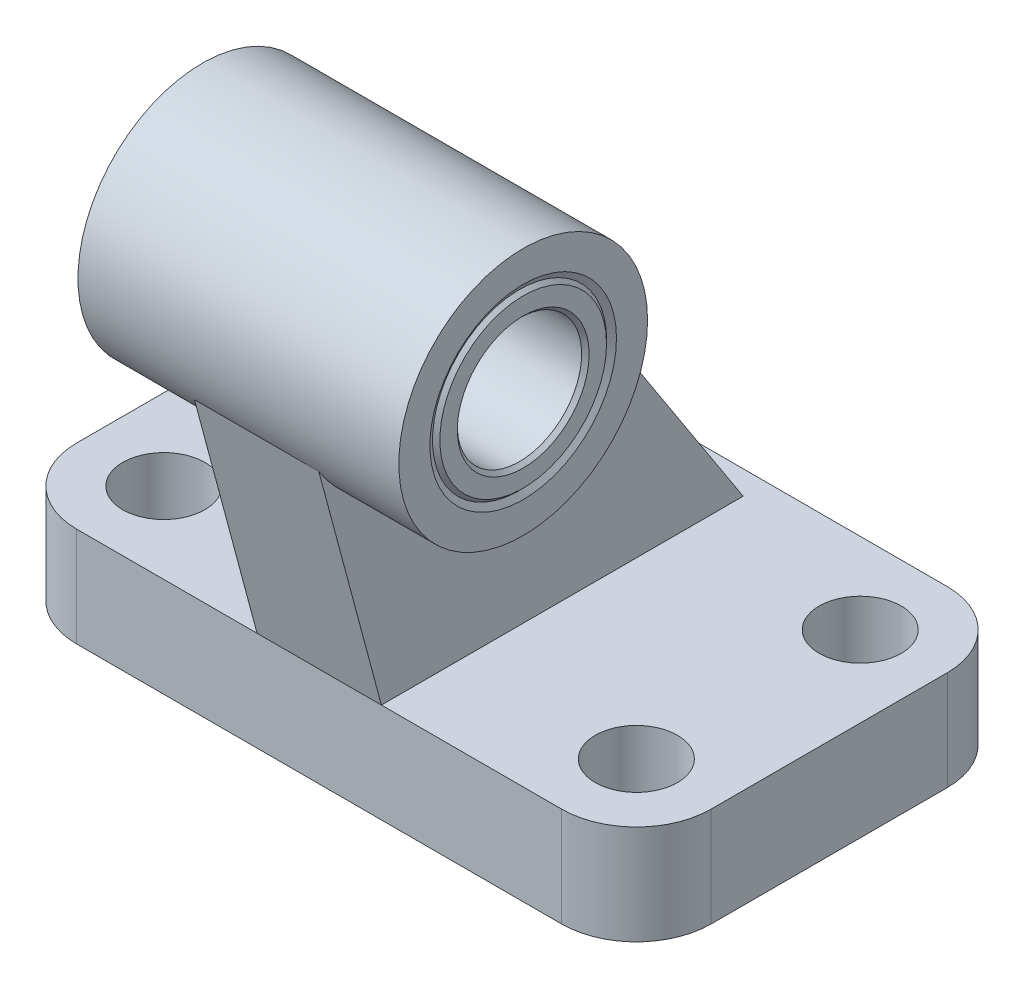
ISO-10303-21;
HEADER;
FILE_DESCRIPTION(('STEP AP214'),'2;1');
FILE_NAME('part.step','',(''),(''),'','','');
FILE_SCHEMA(('AUTOMOTIVE_DESIGN { 1 0 10303 214 1 1 1 1 }'));
ENDSEC;
DATA;
#1=APPLICATION_CONTEXT('core data for automotive mechanical design processes');
#2=APPLICATION_PROTOCOL_DEFINITION('international standard','automotive_design',2000,#1);
#3=PRODUCT_CONTEXT('',#1,'mechanical');
#4=PRODUCT('Part','Part','',(#3));
#5=PRODUCT_RELATED_PRODUCT_CATEGORY('part','',(#4));
#6=PRODUCT_DEFINITION_FORMATION('','',#4);
#7=PRODUCT_DEFINITION_CONTEXT('part definition',#1,'design');
#8=PRODUCT_DEFINITION('design','',#6,#7);
#9=PRODUCT_DEFINITION_SHAPE('','',#8);
#10=(LENGTH_UNIT() NAMED_UNIT(*) SI_UNIT(.MILLI.,.METRE.));
#11=(NAMED_UNIT(*) PLANE_ANGLE_UNIT() SI_UNIT($,.RADIAN.));
#12=(NAMED_UNIT(*) SI_UNIT($,.STERADIAN.) SOLID_ANGLE_UNIT());
#13=UNCERTAINTY_MEASURE_WITH_UNIT(LENGTH_MEASURE(1.E-05),#10,'distance_accuracy_value','');
#14=(GEOMETRIC_REPRESENTATION_CONTEXT(3) GLOBAL_UNCERTAINTY_ASSIGNED_CONTEXT((#13)) GLOBAL_UNIT_ASSIGNED_CONTEXT((#10,
#11,#12)) REPRESENTATION_CONTEXT('',''));
#15=CARTESIAN_POINT('',(0.,0.,0.));
#16=DIRECTION('',(0.,0.,1.));
#17=DIRECTION('',(1.,0.,0.));
#18=AXIS2_PLACEMENT_3D('',#15,#16,#17);
#19=CARTESIAN_POINT('',(12.9,32.,12.));
#20=DIRECTION('',(1.,0.,0.));
#21=DIRECTION('',(0.,0.,-1.));
#22=AXIS2_PLACEMENT_3D('',#19,#20,#21);
#23=CYLINDRICAL_SURFACE('',#22,7.);
#24=CARTESIAN_POINT('',(12.6,32.,12.));
#25=DIRECTION('',(1.,0.,0.));
#26=DIRECTION('',(0.,0.,-1.));
#27=AXIS2_PLACEMENT_3D('',#24,#25,#26);
#28=CIRCLE('',#27,7.);
#29=CARTESIAN_POINT('',(12.6,32.,5.));
#30=VERTEX_POINT('',#29);
#31=EDGE_CURVE('E512',#30,#30,#28,.T.);
#32=ORIENTED_EDGE('',*,*,#31,.F.);
#33=EDGE_LOOP('',(#32));
#34=FACE_BOUND('',#33,.T.);
#35=CARTESIAN_POINT('',(12.6113248654052,32.,12.));
#36=DIRECTION('',(1.,0.,0.));
#37=DIRECTION('',(0.,0.,-1.));
#38=AXIS2_PLACEMENT_3D('',#35,#36,#37);
#39=CIRCLE('',#38,7.);
#40=CARTESIAN_POINT('',(12.6113248654052,32.,5.));
#41=VERTEX_POINT('',#40);
#42=EDGE_CURVE('E303',#41,#41,#39,.T.);
#43=ORIENTED_EDGE('',*,*,#42,.T.);
#44=EDGE_LOOP('',(#43));
#45=FACE_BOUND('',#44,.T.);
#46=ADVANCED_FACE('F32',(#34,#45),#23,.F.);
#47=CARTESIAN_POINT('',(5.,29.5173048454133,21.2655444566228));
#48=DIRECTION('',(0.,0.258819045102522,-0.965925826289068));
#49=DIRECTION('',(0.,0.965925826289068,0.258819045102522));
#50=AXIS2_PLACEMENT_3D('',#47,#48,#49);
#51=PLANE('',#50);
#52=DIRECTION('',(-1.,0.,0.));
#53=VECTOR('',#52,1.);
#54=CARTESIAN_POINT('',(12.9,26.7876608921533,20.5341385637223));
#55=LINE('',#54,#53);
#56=CARTESIAN_POINT('',(-5.,26.7876608921533,20.5341385637223));
#57=VERTEX_POINT('',#56);
#58=CARTESIAN_POINT('',(5.,26.7876608921533,20.5341385637223));
#59=VERTEX_POINT('',#58);
#60=EDGE_CURVE('E132',#57,#59,#55,.F.);
#61=ORIENTED_EDGE('',*,*,#60,.F.);
#62=DIRECTION('',(0.,-0.965925826289068,-0.258819045102522));
#63=VECTOR('',#62,1.);
#64=CARTESIAN_POINT('',(-5.,29.5173048454133,21.2655444566228));
#65=LINE('',#64,#63);
#66=CARTESIAN_POINT('',(-5.,8.,15.5));
#67=VERTEX_POINT('',#66);
#68=EDGE_CURVE('E122',#57,#67,#65,.T.);
#69=ORIENTED_EDGE('',*,*,#68,.T.);
#70=DIRECTION('',(-1.,0.,0.));
#71=VECTOR('',#70,1.);
#72=CARTESIAN_POINT('',(5.,8.,15.5));
#73=LINE('',#72,#71);
#74=CARTESIAN_POINT('',(5.,8.,15.5));
#75=VERTEX_POINT('',#74);
#76=EDGE_CURVE('E159',#75,#67,#73,.T.);
#77=ORIENTED_EDGE('',*,*,#76,.F.);
#78=DIRECTION('',(0.,-0.965925826289068,-0.258819045102522));
#79=VECTOR('',#78,1.);
#80=CARTESIAN_POINT('',(5.,29.5173048454133,21.2655444566228));
#81=LINE('',#80,#79);
#82=EDGE_CURVE('E134',#59,#75,#81,.T.);
#83=ORIENTED_EDGE('',*,*,#82,.F.);
#84=EDGE_LOOP('',(#61,#69,#77,#83));
#85=FACE_BOUND('',#84,.T.);
#86=ADVANCED_FACE('F133',(#85),#51,.F.);
#87=CARTESIAN_POINT('',(5.,8.,-13.5857822367403));
#88=DIRECTION('',(0.,-0.544639035015027,0.838670567945424));
#89=DIRECTION('',(0.,-0.838670567945424,-0.544639035015027));
#90=AXIS2_PLACEMENT_3D('',#87,#88,#89);
#91=PLANE('',#90);
#92=DIRECTION('',(-1.,0.,0.));
#93=VECTOR('',#92,1.);
#94=CARTESIAN_POINT('',(12.9,32.0000000000001,2.));
#95=LINE('',#94,#93);
#96=CARTESIAN_POINT('',(5.,32.0000000000001,2.));
#97=VERTEX_POINT('',#96);
#98=CARTESIAN_POINT('',(-5.,32.0000000000001,2.));
#99=VERTEX_POINT('',#98);
#100=EDGE_CURVE('E47',#97,#99,#95,.T.);
#101=ORIENTED_EDGE('',*,*,#100,.F.);
#102=DIRECTION('',(0.,0.838670567945424,0.544639035015027));
#103=VECTOR('',#102,1.);
#104=CARTESIAN_POINT('',(5.,8.,-13.5857822367403));
#105=LINE('',#104,#103);
#106=CARTESIAN_POINT('',(5.,8.,-13.5857822367403));
#107=VERTEX_POINT('',#106);
#108=EDGE_CURVE('E154',#107,#97,#105,.T.);
#109=ORIENTED_EDGE('',*,*,#108,.F.);
#110=DIRECTION('',(-1.,0.,0.));
#111=VECTOR('',#110,1.);
#112=CARTESIAN_POINT('',(5.,8.,-13.5857822367403));
#113=LINE('',#112,#111);
#114=CARTESIAN_POINT('',(-5.,8.,-13.5857822367403));
#115=VERTEX_POINT('',#114);
#116=EDGE_CURVE('E156',#107,#115,#113,.T.);
#117=ORIENTED_EDGE('',*,*,#116,.T.);
#118=DIRECTION('',(0.,0.838670567945424,0.544639035015027));
#119=VECTOR('',#118,1.);
#120=CARTESIAN_POINT('',(-5.,8.,-13.5857822367403));
#121=LINE('',#120,#119);
#122=EDGE_CURVE('E148',#115,#99,#121,.T.);
#123=ORIENTED_EDGE('',*,*,#122,.T.);
#124=EDGE_LOOP('',(#101,#109,#117,#123));
#125=FACE_BOUND('',#124,.T.);
#126=ADVANCED_FACE('F276',(#125),#91,.F.);
#127=CARTESIAN_POINT('',(-19.5000000000001,8.,9.50000000000006));
#128=DIRECTION('',(0.,1.,0.));
#129=DIRECTION('',(0.,0.,1.));
#130=AXIS2_PLACEMENT_3D('',#127,#128,#129);
#131=PLANE('',#130);
#132=CARTESIAN_POINT('',(19.,8.,-9.));
#133=DIRECTION('',(0.,1.,0.));
#134=DIRECTION('',(0.,0.,1.));
#135=AXIS2_PLACEMENT_3D('',#132,#133,#134);
#136=CIRCLE('',#135,3.3);
#137=CARTESIAN_POINT('',(19.,8.,-5.7));
#138=VERTEX_POINT('',#137);
#139=EDGE_CURVE('E306',#138,#138,#136,.T.);
#140=ORIENTED_EDGE('',*,*,#139,.F.);
#141=EDGE_LOOP('',(#140));
#142=FACE_BOUND('',#141,.T.);
#143=CARTESIAN_POINT('',(-19.,8.,-9.));
#144=DIRECTION('',(0.,1.,0.));
#145=DIRECTION('',(0.,0.,1.));
#146=AXIS2_PLACEMENT_3D('',#143,#144,#145);
#147=CIRCLE('',#146,3.3);
#148=CARTESIAN_POINT('',(-19.,8.,-5.7));
#149=VERTEX_POINT('',#148);
#150=EDGE_CURVE('E318',#149,#149,#147,.T.);
#151=ORIENTED_EDGE('',*,*,#150,.F.);
#152=EDGE_LOOP('',(#151));
#153=FACE_BOUND('',#152,.T.);
#154=CARTESIAN_POINT('',(19.,8.,9.));
#155=DIRECTION('',(0.,1.,0.));
#156=DIRECTION('',(0.,0.,1.));
#157=AXIS2_PLACEMENT_3D('',#154,#155,#156);
#158=CIRCLE('',#157,3.3);
#159=CARTESIAN_POINT('',(19.,8.,12.3));
#160=VERTEX_POINT('',#159);
#161=EDGE_CURVE('E324',#160,#160,#158,.T.);
#162=ORIENTED_EDGE('',*,*,#161,.F.);
#163=EDGE_LOOP('',(#162));
#164=FACE_BOUND('',#163,.T.);
#165=CARTESIAN_POINT('',(-19.,8.,9.));
#166=DIRECTION('',(0.,1.,0.));
#167=DIRECTION('',(0.,0.,1.));
#168=AXIS2_PLACEMENT_3D('',#165,#166,#167);
#169=CIRCLE('',#168,3.3);
#170=CARTESIAN_POINT('',(-19.,8.,12.3));
#171=VERTEX_POINT('',#170);
#172=EDGE_CURVE('E330',#171,#171,#169,.T.);
#173=ORIENTED_EDGE('',*,*,#172,.F.);
#174=EDGE_LOOP('',(#173));
#175=FACE_BOUND('',#174,.T.);
#176=DIRECTION('',(1.,0.,0.));
#177=VECTOR('',#176,1.);
#178=CARTESIAN_POINT('',(-19.5,8.,15.5));
#179=LINE('',#178,#177);
#180=CARTESIAN_POINT('',(-19.5,8.,15.5));
#181=VERTEX_POINT('',#180);
#182=EDGE_CURVE('E167',#181,#67,#179,.T.);
#183=ORIENTED_EDGE('',*,*,#182,.T.);
#184=DIRECTION('',(0.,0.,-1.));
#185=VECTOR('',#184,1.);
#186=CARTESIAN_POINT('',(-5.,8.,15.5));
#187=LINE('',#186,#185);
#188=EDGE_CURVE('E126',#67,#115,#187,.T.);
#189=ORIENTED_EDGE('',*,*,#188,.T.);
#190=ORIENTED_EDGE('',*,*,#116,.F.);
#191=DIRECTION('',(0.,0.,-1.));
#192=VECTOR('',#191,1.);
#193=CARTESIAN_POINT('',(5.,8.,15.5));
#194=LINE('',#193,#192);
#195=EDGE_CURVE('E151',#75,#107,#194,.T.);
#196=ORIENTED_EDGE('',*,*,#195,.F.);
#197=CARTESIAN_POINT('',(19.5,8.,15.5));
#198=VERTEX_POINT('',#197);
#199=EDGE_CURVE('E165',#75,#198,#179,.T.);
#200=ORIENTED_EDGE('',*,*,#199,.T.);
#201=CARTESIAN_POINT('',(19.5000000000001,8.,9.50000000000005));
#202=DIRECTION('',(0.,1.,0.));
#203=DIRECTION('',(0.,0.,1.));
#204=AXIS2_PLACEMENT_3D('',#201,#202,#203);
#205=CIRCLE('',#204,5.99999999999994);
#206=CARTESIAN_POINT('',(25.5,8.,9.5));
#207=VERTEX_POINT('',#206);
#208=EDGE_CURVE('E170',#198,#207,#205,.T.);
#209=ORIENTED_EDGE('',*,*,#208,.T.);
#210=DIRECTION('',(0.,0.,-1.));
#211=VECTOR('',#210,1.);
#212=CARTESIAN_POINT('',(25.5,8.,9.5));
#213=LINE('',#212,#211);
#214=CARTESIAN_POINT('',(25.5,8.,-9.5));
#215=VERTEX_POINT('',#214);
#216=EDGE_CURVE('E172',#207,#215,#213,.T.);
#217=ORIENTED_EDGE('',*,*,#216,.T.);
#218=CARTESIAN_POINT('',(19.5000000000001,8.,-9.50000000000006));
#219=DIRECTION('',(0.,1.,0.));
#220=DIRECTION('',(0.,0.,1.));
#221=AXIS2_PLACEMENT_3D('',#218,#219,#220);
#222=CIRCLE('',#221,5.99999999999995);
#223=CARTESIAN_POINT('',(19.5,8.,-15.5));
#224=VERTEX_POINT('',#223);
#225=EDGE_CURVE('E174',#215,#224,#222,.T.);
#226=ORIENTED_EDGE('',*,*,#225,.T.);
#227=DIRECTION('',(-1.,0.,0.));
#228=VECTOR('',#227,1.);
#229=CARTESIAN_POINT('',(19.5,8.,-15.5));
#230=LINE('',#229,#228);
#231=CARTESIAN_POINT('',(-19.5,8.,-15.5));
#232=VERTEX_POINT('',#231);
#233=EDGE_CURVE('E176',#224,#232,#230,.T.);
#234=ORIENTED_EDGE('',*,*,#233,.T.);
#235=CARTESIAN_POINT('',(-19.5000000000001,8.,-9.50000000000005));
#236=DIRECTION('',(0.,1.,0.));
#237=DIRECTION('',(0.,0.,1.));
#238=AXIS2_PLACEMENT_3D('',#235,#236,#237);
#239=CIRCLE('',#238,5.99999999999994);
#240=CARTESIAN_POINT('',(-25.5,8.,-9.5));
#241=VERTEX_POINT('',#240);
#242=EDGE_CURVE('E178',#232,#241,#239,.T.);
#243=ORIENTED_EDGE('',*,*,#242,.T.);
#244=DIRECTION('',(0.,0.,1.));
#245=VECTOR('',#244,1.);
#246=CARTESIAN_POINT('',(-25.5,8.,-9.5));
#247=LINE('',#246,#245);
#248=CARTESIAN_POINT('',(-25.5,8.,9.5));
#249=VERTEX_POINT('',#248);
#250=EDGE_CURVE('E180',#241,#249,#247,.T.);
#251=ORIENTED_EDGE('',*,*,#250,.T.);
#252=CARTESIAN_POINT('',(-19.5000000000001,8.,9.50000000000006));
#253=DIRECTION('',(0.,1.,0.));
#254=DIRECTION('',(0.,0.,1.));
#255=AXIS2_PLACEMENT_3D('',#252,#253,#254);
#256=CIRCLE('',#255,5.99999999999995);
#257=EDGE_CURVE('E162',#249,#181,#256,.T.);
#258=ORIENTED_EDGE('',*,*,#257,.T.);
#259=EDGE_LOOP('',(#183,#189,#190,#196,#200,#209,#217,#226,#234,#243,#251,#258));
#260=FACE_BOUND('',#259,.T.);
#261=ADVANCED_FACE('F243',(#142,#153,#164,#175,#260),#131,.T.);
#262=CARTESIAN_POINT('',(-19.5000000000001,8.,9.50000000000006));
#263=DIRECTION('',(0.,-1.,0.));
#264=DIRECTION('',(0.,0.,-1.));
#265=AXIS2_PLACEMENT_3D('',#262,#263,#264);
#266=CYLINDRICAL_SURFACE('',#265,5.99999999999995);
#267=CARTESIAN_POINT('',(-19.5000000000001,0.,9.50000000000006));
#268=DIRECTION('',(0.,1.,0.));
#269=DIRECTION('',(0.,0.,1.));
#270=AXIS2_PLACEMENT_3D('',#267,#268,#269);
#271=CIRCLE('',#270,5.99999999999995);
#272=CARTESIAN_POINT('',(-25.5,0.,9.5));
#273=VERTEX_POINT('',#272);
#274=CARTESIAN_POINT('',(-19.5,0.,15.5));
#275=VERTEX_POINT('',#274);
#276=EDGE_CURVE('E161',#273,#275,#271,.T.);
#277=ORIENTED_EDGE('',*,*,#276,.T.);
#278=DIRECTION('',(0.,-1.,0.));
#279=VECTOR('',#278,1.);
#280=CARTESIAN_POINT('',(-19.5,8.,15.5));
#281=LINE('',#280,#279);
#282=EDGE_CURVE('E40',#181,#275,#281,.T.);
#283=ORIENTED_EDGE('',*,*,#282,.F.);
#284=ORIENTED_EDGE('',*,*,#257,.F.);
#285=DIRECTION('',(0.,-1.,0.));
#286=VECTOR('',#285,1.);
#287=CARTESIAN_POINT('',(-25.5,8.,9.5));
#288=LINE('',#287,#286);
#289=EDGE_CURVE('E182',#249,#273,#288,.T.);
#290=ORIENTED_EDGE('',*,*,#289,.T.);
#291=EDGE_LOOP('',(#277,#283,#284,#290));
#292=FACE_BOUND('',#291,.T.);
#293=ADVANCED_FACE('F34',(#292),#266,.T.);
#294=CARTESIAN_POINT('',(-19.5,8.,15.5));
#295=DIRECTION('',(0.,0.,-1.));
#296=DIRECTION('',(-1.,0.,0.));
#297=AXIS2_PLACEMENT_3D('',#294,#295,#296);
#298=PLANE('',#297);
#299=DIRECTION('',(1.,0.,0.));
#300=VECTOR('',#299,1.);
#301=CARTESIAN_POINT('',(-19.5,0.,15.5));
#302=LINE('',#301,#300);
#303=CARTESIAN_POINT('',(19.5,0.,15.5));
#304=VERTEX_POINT('',#303);
#305=EDGE_CURVE('E185',#275,#304,#302,.T.);
#306=ORIENTED_EDGE('',*,*,#305,.T.);
#307=DIRECTION('',(0.,-1.,0.));
#308=VECTOR('',#307,1.);
#309=CARTESIAN_POINT('',(19.5,8.,15.5));
#310=LINE('',#309,#308);
#311=EDGE_CURVE('E215',#198,#304,#310,.T.);
#312=ORIENTED_EDGE('',*,*,#311,.F.);
#313=ORIENTED_EDGE('',*,*,#199,.F.);
#314=ORIENTED_EDGE('',*,*,#76,.T.);
#315=ORIENTED_EDGE('',*,*,#182,.F.);
#316=ORIENTED_EDGE('',*,*,#282,.T.);
#317=EDGE_LOOP('',(#306,#312,#313,#314,#315,#316));
#318=FACE_BOUND('',#317,.T.);
#319=ADVANCED_FACE('F220',(#318),#298,.F.);
#320=CARTESIAN_POINT('',(19.5000000000001,8.,9.50000000000005));
#321=DIRECTION('',(0.,-1.,0.));
#322=DIRECTION('',(0.,0.,-1.));
#323=AXIS2_PLACEMENT_3D('',#320,#321,#322);
#324=CYLINDRICAL_SURFACE('',#323,5.99999999999994);
#325=CARTESIAN_POINT('',(19.5000000000001,0.,9.50000000000005));
#326=DIRECTION('',(0.,1.,0.));
#327=DIRECTION('',(0.,0.,1.));
#328=AXIS2_PLACEMENT_3D('',#325,#326,#327);
#329=CIRCLE('',#328,5.99999999999994);
#330=CARTESIAN_POINT('',(25.5,0.,9.5));
#331=VERTEX_POINT('',#330);
#332=EDGE_CURVE('E187',#304,#331,#329,.T.);
#333=ORIENTED_EDGE('',*,*,#332,.T.);
#334=DIRECTION('',(0.,-1.,0.));
#335=VECTOR('',#334,1.);
#336=CARTESIAN_POINT('',(25.5,8.,9.5));
#337=LINE('',#336,#335);
#338=EDGE_CURVE('E212',#207,#331,#337,.T.);
#339=ORIENTED_EDGE('',*,*,#338,.F.);
#340=ORIENTED_EDGE('',*,*,#208,.F.);
#341=ORIENTED_EDGE('',*,*,#311,.T.);
#342=EDGE_LOOP('',(#333,#339,#340,#341));
#343=FACE_BOUND('',#342,.T.);
#344=ADVANCED_FACE('F235',(#343),#324,.T.);
#345=CARTESIAN_POINT('',(25.5,8.,9.5));
#346=DIRECTION('',(-1.,0.,0.));
#347=DIRECTION('',(0.,0.,1.));
#348=AXIS2_PLACEMENT_3D('',#345,#346,#347);
#349=PLANE('',#348);
#350=DIRECTION('',(0.,0.,-1.));
#351=VECTOR('',#350,1.);
#352=CARTESIAN_POINT('',(25.5,0.,9.5));
#353=LINE('',#352,#351);
#354=CARTESIAN_POINT('',(25.5,0.,-9.5));
#355=VERTEX_POINT('',#354);
#356=EDGE_CURVE('E189',#331,#355,#353,.T.);
#357=ORIENTED_EDGE('',*,*,#356,.T.);
#358=DIRECTION('',(0.,-1.,0.));
#359=VECTOR('',#358,1.);
#360=CARTESIAN_POINT('',(25.5,8.,-9.5));
#361=LINE('',#360,#359);
#362=EDGE_CURVE('E209',#215,#355,#361,.T.);
#363=ORIENTED_EDGE('',*,*,#362,.F.);
#364=ORIENTED_EDGE('',*,*,#216,.F.);
#365=ORIENTED_EDGE('',*,*,#338,.T.);
#366=EDGE_LOOP('',(#357,#363,#364,#365));
#367=FACE_BOUND('',#366,.T.);
#368=ADVANCED_FACE('F239',(#367),#349,.F.);
#369=CARTESIAN_POINT('',(19.5000000000001,8.,-9.50000000000006));
#370=DIRECTION('',(0.,-1.,0.));
#371=DIRECTION('',(0.,0.,-1.));
#372=AXIS2_PLACEMENT_3D('',#369,#370,#371);
#373=CYLINDRICAL_SURFACE('',#372,5.99999999999995);
#374=CARTESIAN_POINT('',(19.5000000000001,0.,-9.50000000000006));
#375=DIRECTION('',(0.,1.,0.));
#376=DIRECTION('',(0.,0.,1.));
#377=AXIS2_PLACEMENT_3D('',#374,#375,#376);
#378=CIRCLE('',#377,5.99999999999995);
#379=CARTESIAN_POINT('',(19.5,0.,-15.5));
#380=VERTEX_POINT('',#379);
#381=EDGE_CURVE('E191',#355,#380,#378,.T.);
#382=ORIENTED_EDGE('',*,*,#381,.T.);
#383=DIRECTION('',(0.,-1.,0.));
#384=VECTOR('',#383,1.);
#385=CARTESIAN_POINT('',(19.5,8.,-15.5));
#386=LINE('',#385,#384);
#387=EDGE_CURVE('E206',#224,#380,#386,.T.);
#388=ORIENTED_EDGE('',*,*,#387,.F.);
#389=ORIENTED_EDGE('',*,*,#225,.F.);
#390=ORIENTED_EDGE('',*,*,#362,.T.);
#391=EDGE_LOOP('',(#382,#388,#389,#390));
#392=FACE_BOUND('',#391,.T.);
#393=ADVANCED_FACE('F260',(#392),#373,.T.);
#394=CARTESIAN_POINT('',(19.5,8.,-15.5));
#395=DIRECTION('',(0.,0.,1.));
#396=DIRECTION('',(1.,0.,0.));
#397=AXIS2_PLACEMENT_3D('',#394,#395,#396);
#398=PLANE('',#397);
#399=DIRECTION('',(-1.,0.,0.));
#400=VECTOR('',#399,1.);
#401=CARTESIAN_POINT('',(19.5,0.,-15.5));
#402=LINE('',#401,#400);
#403=CARTESIAN_POINT('',(-19.5,0.,-15.5));
#404=VERTEX_POINT('',#403);
#405=EDGE_CURVE('E193',#380,#404,#402,.T.);
#406=ORIENTED_EDGE('',*,*,#405,.T.);
#407=DIRECTION('',(0.,-1.,0.));
#408=VECTOR('',#407,1.);
#409=CARTESIAN_POINT('',(-19.5,8.,-15.5));
#410=LINE('',#409,#408);
#411=EDGE_CURVE('E203',#232,#404,#410,.T.);
#412=ORIENTED_EDGE('',*,*,#411,.F.);
#413=ORIENTED_EDGE('',*,*,#233,.F.);
#414=ORIENTED_EDGE('',*,*,#387,.T.);
#415=EDGE_LOOP('',(#406,#412,#413,#414));
#416=FACE_BOUND('',#415,.T.);
#417=ADVANCED_FACE('F257',(#416),#398,.F.);
#418=CARTESIAN_POINT('',(-19.5000000000001,8.,-9.50000000000005));
#419=DIRECTION('',(0.,-1.,0.));
#420=DIRECTION('',(0.,0.,-1.));
#421=AXIS2_PLACEMENT_3D('',#418,#419,#420);
#422=CYLINDRICAL_SURFACE('',#421,5.99999999999994);
#423=CARTESIAN_POINT('',(-19.5000000000001,0.,-9.50000000000005));
#424=DIRECTION('',(0.,1.,0.));
#425=DIRECTION('',(0.,0.,1.));
#426=AXIS2_PLACEMENT_3D('',#423,#424,#425);
#427=CIRCLE('',#426,5.99999999999994);
#428=CARTESIAN_POINT('',(-25.5,0.,-9.5));
#429=VERTEX_POINT('',#428);
#430=EDGE_CURVE('E195',#404,#429,#427,.T.);
#431=ORIENTED_EDGE('',*,*,#430,.T.);
#432=DIRECTION('',(0.,-1.,0.));
#433=VECTOR('',#432,1.);
#434=CARTESIAN_POINT('',(-25.5,8.,-9.5));
#435=LINE('',#434,#433);
#436=EDGE_CURVE('E200',#241,#429,#435,.T.);
#437=ORIENTED_EDGE('',*,*,#436,.F.);
#438=ORIENTED_EDGE('',*,*,#242,.F.);
#439=ORIENTED_EDGE('',*,*,#411,.T.);
#440=EDGE_LOOP('',(#431,#437,#438,#439));
#441=FACE_BOUND('',#440,.T.);
#442=ADVANCED_FACE('F253',(#441),#422,.T.);
#443=CARTESIAN_POINT('',(-25.5,8.,-9.5));
#444=DIRECTION('',(1.,0.,0.));
#445=DIRECTION('',(0.,0.,-1.));
#446=AXIS2_PLACEMENT_3D('',#443,#444,#445);
#447=PLANE('',#446);
#448=DIRECTION('',(0.,0.,1.));
#449=VECTOR('',#448,1.);
#450=CARTESIAN_POINT('',(-25.5,0.,-9.5));
#451=LINE('',#450,#449);
#452=EDGE_CURVE('E166',#429,#273,#451,.T.);
#453=ORIENTED_EDGE('',*,*,#452,.T.);
#454=ORIENTED_EDGE('',*,*,#289,.F.);
#455=ORIENTED_EDGE('',*,*,#250,.F.);
#456=ORIENTED_EDGE('',*,*,#436,.T.);
#457=EDGE_LOOP('',(#453,#454,#455,#456));
#458=FACE_BOUND('',#457,.T.);
#459=ADVANCED_FACE('F251',(#458),#447,.F.);
#460=CARTESIAN_POINT('',(-19.5000000000001,0.,9.50000000000006));
#461=DIRECTION('',(0.,1.,0.));
#462=DIRECTION('',(0.,0.,1.));
#463=AXIS2_PLACEMENT_3D('',#460,#461,#462);
#464=PLANE('',#463);
#465=CARTESIAN_POINT('',(19.,0.,-9.));
#466=DIRECTION('',(0.,1.,0.));
#467=DIRECTION('',(0.,0.,1.));
#468=AXIS2_PLACEMENT_3D('',#465,#466,#467);
#469=CIRCLE('',#468,3.3);
#470=CARTESIAN_POINT('',(19.,0.,-5.7));
#471=VERTEX_POINT('',#470);
#472=EDGE_CURVE('E315',#471,#471,#469,.T.);
#473=ORIENTED_EDGE('',*,*,#472,.T.);
#474=EDGE_LOOP('',(#473));
#475=FACE_BOUND('',#474,.T.);
#476=CARTESIAN_POINT('',(-19.,0.,-9.));
#477=DIRECTION('',(0.,1.,0.));
#478=DIRECTION('',(0.,0.,1.));
#479=AXIS2_PLACEMENT_3D('',#476,#477,#478);
#480=CIRCLE('',#479,3.3);
#481=CARTESIAN_POINT('',(-19.,0.,-5.7));
#482=VERTEX_POINT('',#481);
#483=EDGE_CURVE('E321',#482,#482,#480,.T.);
#484=ORIENTED_EDGE('',*,*,#483,.T.);
#485=EDGE_LOOP('',(#484));
#486=FACE_BOUND('',#485,.T.);
#487=CARTESIAN_POINT('',(19.,0.,9.));
#488=DIRECTION('',(0.,1.,0.));
#489=DIRECTION('',(0.,0.,1.));
#490=AXIS2_PLACEMENT_3D('',#487,#488,#489);
#491=CIRCLE('',#490,3.3);
#492=CARTESIAN_POINT('',(19.,0.,12.3));
#493=VERTEX_POINT('',#492);
#494=EDGE_CURVE('E327',#493,#493,#491,.T.);
#495=ORIENTED_EDGE('',*,*,#494,.T.);
#496=EDGE_LOOP('',(#495));
#497=FACE_BOUND('',#496,.T.);
#498=CARTESIAN_POINT('',(-19.,0.,9.));
#499=DIRECTION('',(0.,1.,0.));
#500=DIRECTION('',(0.,0.,1.));
#501=AXIS2_PLACEMENT_3D('',#498,#499,#500);
#502=CIRCLE('',#501,3.3);
#503=CARTESIAN_POINT('',(-19.,0.,12.3));
#504=VERTEX_POINT('',#503);
#505=EDGE_CURVE('E333',#504,#504,#502,.T.);
#506=ORIENTED_EDGE('',*,*,#505,.T.);
#507=EDGE_LOOP('',(#506));
#508=FACE_BOUND('',#507,.T.);
#509=ORIENTED_EDGE('',*,*,#276,.F.);
#510=ORIENTED_EDGE('',*,*,#452,.F.);
#511=ORIENTED_EDGE('',*,*,#430,.F.);
#512=ORIENTED_EDGE('',*,*,#405,.F.);
#513=ORIENTED_EDGE('',*,*,#381,.F.);
#514=ORIENTED_EDGE('',*,*,#356,.F.);
#515=ORIENTED_EDGE('',*,*,#332,.F.);
#516=ORIENTED_EDGE('',*,*,#305,.F.);
#517=EDGE_LOOP('',(#509,#510,#511,#512,#513,#514,#515,#516));
#518=FACE_BOUND('',#517,.T.);
#519=ADVANCED_FACE('F228',(#475,#486,#497,#508,#518),#464,.F.);
#520=CARTESIAN_POINT('',(5.,0.,0.));
#521=DIRECTION('',(1.,0.,0.));
#522=DIRECTION('',(0.,0.,-1.));
#523=AXIS2_PLACEMENT_3D('',#520,#521,#522);
#524=PLANE('',#523);
#525=ORIENTED_EDGE('',*,*,#108,.T.);
#526=CARTESIAN_POINT('',(5.,32.,12.));
#527=DIRECTION('',(1.,0.,0.));
#528=DIRECTION('',(0.,0.,-1.));
#529=AXIS2_PLACEMENT_3D('',#526,#527,#528);
#530=CIRCLE('',#529,10.);
#531=EDGE_CURVE('E54',#97,#59,#530,.F.);
#532=ORIENTED_EDGE('',*,*,#531,.T.);
#533=ORIENTED_EDGE('',*,*,#82,.T.);
#534=ORIENTED_EDGE('',*,*,#195,.T.);
#535=EDGE_LOOP('',(#525,#532,#533,#534));
#536=FACE_BOUND('',#535,.T.);
#537=ADVANCED_FACE('F360',(#536),#524,.T.);
#538=CARTESIAN_POINT('',(-5.,0.,0.));
#539=DIRECTION('',(1.,0.,0.));
#540=DIRECTION('',(0.,0.,-1.));
#541=AXIS2_PLACEMENT_3D('',#538,#539,#540);
#542=PLANE('',#541);
#543=CARTESIAN_POINT('',(-5.,32.,12.));
#544=DIRECTION('',(1.,0.,0.));
#545=DIRECTION('',(0.,0.,-1.));
#546=AXIS2_PLACEMENT_3D('',#543,#544,#545);
#547=CIRCLE('',#546,10.);
#548=EDGE_CURVE('E11',#99,#57,#547,.F.);
#549=ORIENTED_EDGE('',*,*,#548,.F.);
#550=ORIENTED_EDGE('',*,*,#122,.F.);
#551=ORIENTED_EDGE('',*,*,#188,.F.);
#552=ORIENTED_EDGE('',*,*,#68,.F.);
#553=EDGE_LOOP('',(#549,#550,#551,#552));
#554=FACE_BOUND('',#553,.T.);
#555=ADVANCED_FACE('F124',(#554),#542,.F.);
#556=CARTESIAN_POINT('',(12.9,32.,12.));
#557=DIRECTION('',(-1.,0.,0.));
#558=DIRECTION('',(0.,0.,1.));
#559=AXIS2_PLACEMENT_3D('',#556,#557,#558);
#560=CYLINDRICAL_SURFACE('',#559,10.);
#561=ORIENTED_EDGE('',*,*,#531,.F.);
#562=ORIENTED_EDGE('',*,*,#100,.T.);
#563=ORIENTED_EDGE('',*,*,#548,.T.);
#564=ORIENTED_EDGE('',*,*,#60,.T.);
#565=EDGE_LOOP('',(#561,#562,#563,#564));
#566=FACE_BOUND('',#565,.T.);
#567=CARTESIAN_POINT('',(12.9,32.,12.));
#568=DIRECTION('',(1.,0.,0.));
#569=DIRECTION('',(0.,0.,-1.));
#570=AXIS2_PLACEMENT_3D('',#567,#568,#569);
#571=CIRCLE('',#570,10.);
#572=CARTESIAN_POINT('',(12.9,32.,2.));
#573=VERTEX_POINT('',#572);
#574=EDGE_CURVE('E139',#573,#573,#571,.T.);
#575=ORIENTED_EDGE('',*,*,#574,.F.);
#576=EDGE_LOOP('',(#575));
#577=FACE_BOUND('',#576,.T.);
#578=CARTESIAN_POINT('',(-12.9,32.,12.));
#579=DIRECTION('',(1.,0.,0.));
#580=DIRECTION('',(0.,0.,-1.));
#581=AXIS2_PLACEMENT_3D('',#578,#579,#580);
#582=CIRCLE('',#581,10.);
#583=CARTESIAN_POINT('',(-12.9,32.,2.));
#584=VERTEX_POINT('',#583);
#585=EDGE_CURVE('E142',#584,#584,#582,.T.);
#586=ORIENTED_EDGE('',*,*,#585,.T.);
#587=EDGE_LOOP('',(#586));
#588=FACE_BOUND('',#587,.T.);
#589=ADVANCED_FACE('F137',(#566,#577,#588),#560,.T.);
#590=CARTESIAN_POINT('',(12.9,32.,12.));
#591=DIRECTION('',(1.,0.,0.));
#592=DIRECTION('',(0.,0.,-1.));
#593=AXIS2_PLACEMENT_3D('',#590,#591,#592);
#594=PLANE('',#593);
#595=CARTESIAN_POINT('',(12.9,32.,12.));
#596=DIRECTION('',(1.,0.,0.));
#597=DIRECTION('',(0.,0.,-1.));
#598=AXIS2_PLACEMENT_3D('',#595,#596,#597);
#599=CIRCLE('',#598,7.5);
#600=CARTESIAN_POINT('',(12.9,32.,4.5));
#601=VERTEX_POINT('',#600);
#602=EDGE_CURVE('E309',#601,#601,#599,.T.);
#603=ORIENTED_EDGE('',*,*,#602,.F.);
#604=EDGE_LOOP('',(#603));
#605=FACE_BOUND('',#604,.T.);
#606=ORIENTED_EDGE('',*,*,#574,.T.);
#607=EDGE_LOOP('',(#606));
#608=FACE_BOUND('',#607,.T.);
#609=ADVANCED_FACE('F342',(#605,#608),#594,.T.);
#610=CARTESIAN_POINT('',(-12.9,32.,12.));
#611=DIRECTION('',(1.,0.,0.));
#612=DIRECTION('',(0.,0.,-1.));
#613=AXIS2_PLACEMENT_3D('',#610,#611,#612);
#614=PLANE('',#613);
#615=CARTESIAN_POINT('',(-12.9,32.,12.));
#616=DIRECTION('',(1.,0.,0.));
#617=DIRECTION('',(0.,0.,-1.));
#618=AXIS2_PLACEMENT_3D('',#615,#616,#617);
#619=CIRCLE('',#618,7.5);
#620=CARTESIAN_POINT('',(-12.9,32.,4.5));
#621=VERTEX_POINT('',#620);
#622=EDGE_CURVE('E302',#621,#621,#619,.T.);
#623=ORIENTED_EDGE('',*,*,#622,.T.);
#624=EDGE_LOOP('',(#623));
#625=FACE_BOUND('',#624,.T.);
#626=ORIENTED_EDGE('',*,*,#585,.F.);
#627=EDGE_LOOP('',(#626));
#628=FACE_BOUND('',#627,.T.);
#629=ADVANCED_FACE('F339',(#625,#628),#614,.F.);
#630=CARTESIAN_POINT('',(-19.,8.,9.));
#631=DIRECTION('',(0.,1.,0.));
#632=DIRECTION('',(0.,0.,1.));
#633=AXIS2_PLACEMENT_3D('',#630,#631,#632);
#634=CYLINDRICAL_SURFACE('',#633,3.3);
#635=ORIENTED_EDGE('',*,*,#505,.F.);
#636=EDGE_LOOP('',(#635));
#637=FACE_BOUND('',#636,.T.);
#638=ORIENTED_EDGE('',*,*,#172,.T.);
#639=EDGE_LOOP('',(#638));
#640=FACE_BOUND('',#639,.T.);
#641=ADVANCED_FACE('F341',(#637,#640),#634,.F.);
#642=CARTESIAN_POINT('',(19.,8.,9.));
#643=DIRECTION('',(0.,1.,0.));
#644=DIRECTION('',(0.,0.,1.));
#645=AXIS2_PLACEMENT_3D('',#642,#643,#644);
#646=CYLINDRICAL_SURFACE('',#645,3.3);
#647=ORIENTED_EDGE('',*,*,#494,.F.);
#648=EDGE_LOOP('',(#647));
#649=FACE_BOUND('',#648,.T.);
#650=ORIENTED_EDGE('',*,*,#161,.T.);
#651=EDGE_LOOP('',(#650));
#652=FACE_BOUND('',#651,.T.);
#653=ADVANCED_FACE('F349',(#649,#652),#646,.F.);
#654=CARTESIAN_POINT('',(-19.,8.,-9.));
#655=DIRECTION('',(0.,1.,0.));
#656=DIRECTION('',(0.,0.,1.));
#657=AXIS2_PLACEMENT_3D('',#654,#655,#656);
#658=CYLINDRICAL_SURFACE('',#657,3.3);
#659=ORIENTED_EDGE('',*,*,#483,.F.);
#660=EDGE_LOOP('',(#659));
#661=FACE_BOUND('',#660,.T.);
#662=ORIENTED_EDGE('',*,*,#150,.T.);
#663=EDGE_LOOP('',(#662));
#664=FACE_BOUND('',#663,.T.);
#665=ADVANCED_FACE('F550',(#661,#664),#658,.F.);
#666=CARTESIAN_POINT('',(19.,8.,-9.));
#667=DIRECTION('',(0.,1.,0.));
#668=DIRECTION('',(0.,0.,1.));
#669=AXIS2_PLACEMENT_3D('',#666,#667,#668);
#670=CYLINDRICAL_SURFACE('',#669,3.3);
#671=ORIENTED_EDGE('',*,*,#472,.F.);
#672=EDGE_LOOP('',(#671));
#673=FACE_BOUND('',#672,.T.);
#674=ORIENTED_EDGE('',*,*,#139,.T.);
#675=EDGE_LOOP('',(#674));
#676=FACE_BOUND('',#675,.T.);
#677=ADVANCED_FACE('F292',(#673,#676),#670,.F.);
#678=CARTESIAN_POINT('',(-12.6113248654052,32.,12.));
#679=DIRECTION('',(-1.,0.,0.));
#680=DIRECTION('',(0.,0.,1.));
#681=AXIS2_PLACEMENT_3D('',#678,#679,#680);
#682=CONICAL_SURFACE('',#681,7.,1.04719755119662);
#683=ORIENTED_EDGE('',*,*,#622,.F.);
#684=EDGE_LOOP('',(#683));
#685=FACE_BOUND('',#684,.T.);
#686=CARTESIAN_POINT('',(-12.6113248654052,32.,12.));
#687=DIRECTION('',(1.,0.,0.));
#688=DIRECTION('',(0.,0.,-1.));
#689=AXIS2_PLACEMENT_3D('',#686,#687,#688);
#690=CIRCLE('',#689,7.);
#691=CARTESIAN_POINT('',(-12.6113248654052,32.,5.));
#692=VERTEX_POINT('',#691);
#693=EDGE_CURVE('E300',#692,#692,#690,.T.);
#694=ORIENTED_EDGE('',*,*,#693,.T.);
#695=EDGE_LOOP('',(#694));
#696=FACE_BOUND('',#695,.T.);
#697=ADVANCED_FACE('F284',(#685,#696),#682,.F.);
#698=CARTESIAN_POINT('',(-12.6,32.,12.));
#699=DIRECTION('',(1.,0.,0.));
#700=DIRECTION('',(0.,0.,-1.));
#701=AXIS2_PLACEMENT_3D('',#698,#699,#700);
#702=CIRCLE('',#701,7.);
#703=CARTESIAN_POINT('',(-12.6,32.,5.));
#704=VERTEX_POINT('',#703);
#705=EDGE_CURVE('E297',#704,#704,#702,.T.);
#706=ORIENTED_EDGE('',*,*,#705,.T.);
#707=EDGE_LOOP('',(#706));
#708=FACE_BOUND('',#707,.T.);
#709=ORIENTED_EDGE('',*,*,#693,.F.);
#710=EDGE_LOOP('',(#709));
#711=FACE_BOUND('',#710,.T.);
#712=ADVANCED_FACE('F272',(#708,#711),#23,.F.);
#713=CARTESIAN_POINT('',(12.9,32.,12.));
#714=DIRECTION('',(1.,0.,0.));
#715=DIRECTION('',(0.,0.,-1.));
#716=AXIS2_PLACEMENT_3D('',#713,#714,#715);
#717=CONICAL_SURFACE('',#716,7.5,1.04719755119662);
#718=ORIENTED_EDGE('',*,*,#42,.F.);
#719=EDGE_LOOP('',(#718));
#720=FACE_BOUND('',#719,.T.);
#721=ORIENTED_EDGE('',*,*,#602,.T.);
#722=EDGE_LOOP('',(#721));
#723=FACE_BOUND('',#722,.T.);
#724=ADVANCED_FACE('F283',(#720,#723),#717,.F.);
#725=CARTESIAN_POINT('',(-12.9,38.7,12.));
#726=DIRECTION('',(-1.,0.,0.));
#727=DIRECTION('',(0.,0.,1.));
#728=AXIS2_PLACEMENT_3D('',#725,#726,#727);
#729=PLANE('',#728);
#730=CARTESIAN_POINT('',(-12.9,32.,12.));
#731=DIRECTION('',(1.,0.,0.));
#732=DIRECTION('',(0.,0.,-1.));
#733=AXIS2_PLACEMENT_3D('',#730,#731,#732);
#734=CIRCLE('',#733,5.3);
#735=CARTESIAN_POINT('',(-12.9,32.,6.7));
#736=VERTEX_POINT('',#735);
#737=EDGE_CURVE('E530',#736,#736,#734,.T.);
#738=ORIENTED_EDGE('',*,*,#737,.T.);
#739=EDGE_LOOP('',(#738));
#740=FACE_BOUND('',#739,.T.);
#741=CARTESIAN_POINT('',(-12.9,32.,12.));
#742=DIRECTION('',(1.,0.,0.));
#743=DIRECTION('',(0.,0.,-1.));
#744=AXIS2_PLACEMENT_3D('',#741,#742,#743);
#745=CIRCLE('',#744,6.7);
#746=CARTESIAN_POINT('',(-12.9,32.,5.3));
#747=VERTEX_POINT('',#746);
#748=EDGE_CURVE('E511',#747,#747,#745,.T.);
#749=ORIENTED_EDGE('',*,*,#748,.F.);
#750=EDGE_LOOP('',(#749));
#751=FACE_BOUND('',#750,.T.);
#752=ADVANCED_FACE('F290',(#740,#751),#729,.T.);
#753=CARTESIAN_POINT('',(-12.9,32.,12.));
#754=DIRECTION('',(-1.,0.,0.));
#755=DIRECTION('',(0.,0.,1.));
#756=AXIS2_PLACEMENT_3D('',#753,#754,#755);
#757=CONICAL_SURFACE('',#756,5.3,0.785398163397454);
#758=CARTESIAN_POINT('',(-12.6,32.,12.));
#759=DIRECTION('',(1.,0.,0.));
#760=DIRECTION('',(0.,0.,-1.));
#761=AXIS2_PLACEMENT_3D('',#758,#759,#760);
#762=CIRCLE('',#761,5.);
#763=CARTESIAN_POINT('',(-12.6,32.,7.));
#764=VERTEX_POINT('',#763);
#765=EDGE_CURVE('E527',#764,#764,#762,.T.);
#766=ORIENTED_EDGE('',*,*,#765,.T.);
#767=EDGE_LOOP('',(#766));
#768=FACE_BOUND('',#767,.T.);
#769=ORIENTED_EDGE('',*,*,#737,.F.);
#770=EDGE_LOOP('',(#769));
#771=FACE_BOUND('',#770,.T.);
#772=ADVANCED_FACE('F444',(#768,#771),#757,.F.);
#773=CARTESIAN_POINT('',(12.9,32.,12.));
#774=DIRECTION('',(1.,0.,0.));
#775=DIRECTION('',(0.,0.,-1.));
#776=AXIS2_PLACEMENT_3D('',#773,#774,#775);
#777=CYLINDRICAL_SURFACE('',#776,5.);
#778=CARTESIAN_POINT('',(12.6,32.,12.));
#779=DIRECTION('',(1.,0.,0.));
#780=DIRECTION('',(0.,0.,-1.));
#781=AXIS2_PLACEMENT_3D('',#778,#779,#780);
#782=CIRCLE('',#781,5.);
#783=CARTESIAN_POINT('',(12.6,32.,7.));
#784=VERTEX_POINT('',#783);
#785=EDGE_CURVE('E524',#784,#784,#782,.T.);
#786=ORIENTED_EDGE('',*,*,#785,.T.);
#787=EDGE_LOOP('',(#786));
#788=FACE_BOUND('',#787,.T.);
#789=ORIENTED_EDGE('',*,*,#765,.F.);
#790=EDGE_LOOP('',(#789));
#791=FACE_BOUND('',#790,.T.);
#792=ADVANCED_FACE('F454',(#788,#791),#777,.F.);
#793=CARTESIAN_POINT('',(12.6,32.,12.));
#794=DIRECTION('',(1.,0.,0.));
#795=DIRECTION('',(0.,0.,-1.));
#796=AXIS2_PLACEMENT_3D('',#793,#794,#795);
#797=CONICAL_SURFACE('',#796,5.,0.785398163397451);
#798=CARTESIAN_POINT('',(12.9,32.,12.));
#799=DIRECTION('',(1.,0.,0.));
#800=DIRECTION('',(0.,0.,-1.));
#801=AXIS2_PLACEMENT_3D('',#798,#799,#800);
#802=CIRCLE('',#801,5.3);
#803=CARTESIAN_POINT('',(12.9,32.,6.7));
#804=VERTEX_POINT('',#803);
#805=EDGE_CURVE('E521',#804,#804,#802,.T.);
#806=ORIENTED_EDGE('',*,*,#805,.T.);
#807=EDGE_LOOP('',(#806));
#808=FACE_BOUND('',#807,.T.);
#809=ORIENTED_EDGE('',*,*,#785,.F.);
#810=EDGE_LOOP('',(#809));
#811=FACE_BOUND('',#810,.T.);
#812=ADVANCED_FACE('F464',(#808,#811),#797,.F.);
#813=CARTESIAN_POINT('',(12.9,37.3,12.));
#814=DIRECTION('',(1.,0.,0.));
#815=DIRECTION('',(0.,0.,-1.));
#816=AXIS2_PLACEMENT_3D('',#813,#814,#815);
#817=PLANE('',#816);
#818=CARTESIAN_POINT('',(12.9,32.,12.));
#819=DIRECTION('',(1.,0.,0.));
#820=DIRECTION('',(0.,0.,-1.));
#821=AXIS2_PLACEMENT_3D('',#818,#819,#820);
#822=CIRCLE('',#821,6.7);
#823=CARTESIAN_POINT('',(12.9,32.,5.3));
#824=VERTEX_POINT('',#823);
#825=EDGE_CURVE('E515',#824,#824,#822,.T.);
#826=ORIENTED_EDGE('',*,*,#825,.T.);
#827=EDGE_LOOP('',(#826));
#828=FACE_BOUND('',#827,.T.);
#829=ORIENTED_EDGE('',*,*,#805,.F.);
#830=EDGE_LOOP('',(#829));
#831=FACE_BOUND('',#830,.T.);
#832=ADVANCED_FACE('F474',(#828,#831),#817,.T.);
#833=CARTESIAN_POINT('',(12.9,32.,12.));
#834=DIRECTION('',(-1.,0.,0.));
#835=DIRECTION('',(0.,0.,1.));
#836=AXIS2_PLACEMENT_3D('',#833,#834,#835);
#837=CONICAL_SURFACE('',#836,6.7,0.785398163397451);
#838=ORIENTED_EDGE('',*,*,#31,.T.);
#839=EDGE_LOOP('',(#838));
#840=FACE_BOUND('',#839,.T.);
#841=ORIENTED_EDGE('',*,*,#825,.F.);
#842=EDGE_LOOP('',(#841));
#843=FACE_BOUND('',#842,.T.);
#844=ADVANCED_FACE('F484',(#840,#843),#837,.T.);
#845=CARTESIAN_POINT('',(-12.6,32.,12.));
#846=DIRECTION('',(1.,0.,0.));
#847=DIRECTION('',(0.,0.,-1.));
#848=AXIS2_PLACEMENT_3D('',#845,#846,#847);
#849=CONICAL_SURFACE('',#848,7.,0.785398163397454);
#850=ORIENTED_EDGE('',*,*,#748,.T.);
#851=EDGE_LOOP('',(#850));
#852=FACE_BOUND('',#851,.T.);
#853=ORIENTED_EDGE('',*,*,#705,.F.);
#854=EDGE_LOOP('',(#853));
#855=FACE_BOUND('',#854,.T.);
#856=ADVANCED_FACE('F494',(#852,#855),#849,.T.);
#857=CLOSED_SHELL('',(#46,#86,#126,#261,#293,#319,#344,#368,#393,#417,#442,#459,#519,#537,#555,
#589,#609,#629,#641,#653,#665,#677,#697,#712,#724,#752,#772,#792,#812,#832,#844,#856));
#858=MANIFOLD_SOLID_BREP('B2',#857);
#859=ADVANCED_BREP_SHAPE_REPRESENTATION('',(#18,#858),#14);
#860=SHAPE_DEFINITION_REPRESENTATION(#9,#859);
ENDSEC;
END-ISO-10303-21;
